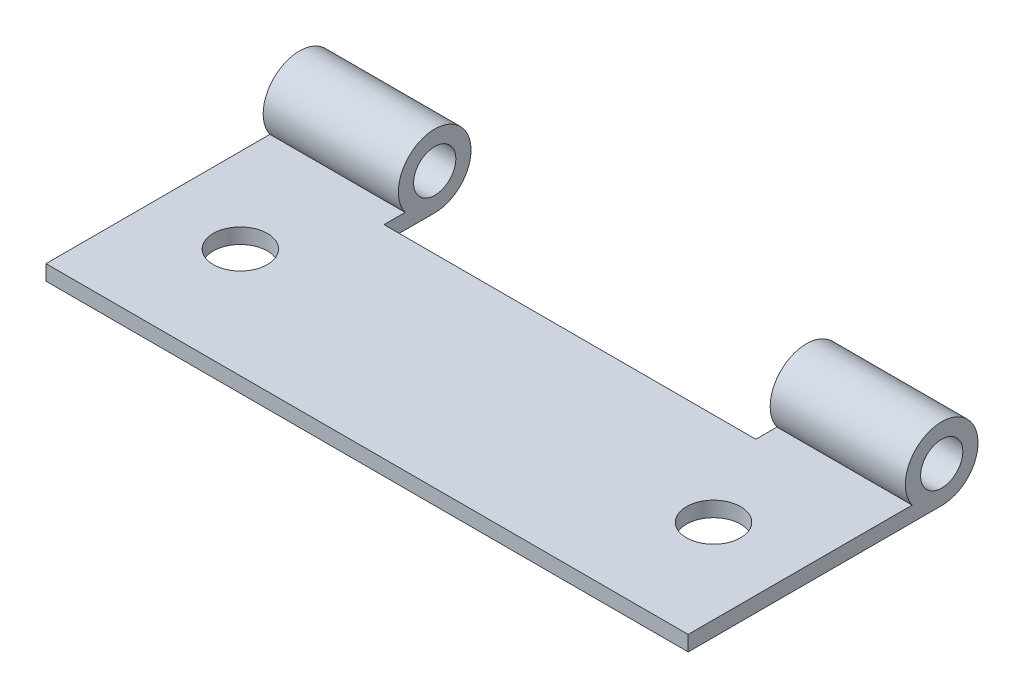
ISO-10303-21;
HEADER;
FILE_DESCRIPTION(('STEP AP214'),'2;1');
FILE_NAME('part.step','',(''),(''),'','','');
FILE_SCHEMA(('AUTOMOTIVE_DESIGN { 1 0 10303 214 1 1 1 1 }'));
ENDSEC;
DATA;
#1=APPLICATION_CONTEXT('core data for automotive mechanical design processes');
#2=APPLICATION_PROTOCOL_DEFINITION('international standard','automotive_design',2000,#1);
#3=PRODUCT_CONTEXT('',#1,'mechanical');
#4=PRODUCT('Part','Part','',(#3));
#5=PRODUCT_RELATED_PRODUCT_CATEGORY('part','',(#4));
#6=PRODUCT_DEFINITION_FORMATION('','',#4);
#7=PRODUCT_DEFINITION_CONTEXT('part definition',#1,'design');
#8=PRODUCT_DEFINITION('design','',#6,#7);
#9=PRODUCT_DEFINITION_SHAPE('','',#8);
#10=(LENGTH_UNIT() NAMED_UNIT(*) SI_UNIT(.MILLI.,.METRE.));
#11=(NAMED_UNIT(*) PLANE_ANGLE_UNIT() SI_UNIT($,.RADIAN.));
#12=(NAMED_UNIT(*) SI_UNIT($,.STERADIAN.) SOLID_ANGLE_UNIT());
#13=UNCERTAINTY_MEASURE_WITH_UNIT(LENGTH_MEASURE(1.E-05),#10,'distance_accuracy_value','');
#14=(GEOMETRIC_REPRESENTATION_CONTEXT(3) GLOBAL_UNCERTAINTY_ASSIGNED_CONTEXT((#13)) GLOBAL_UNIT_ASSIGNED_CONTEXT((#10,
#11,#12)) REPRESENTATION_CONTEXT('',''));
#15=CARTESIAN_POINT('',(0.,0.,0.));
#16=DIRECTION('',(0.,0.,1.));
#17=DIRECTION('',(1.,0.,0.));
#18=AXIS2_PLACEMENT_3D('',#15,#16,#17);
#19=CARTESIAN_POINT('',(38.,0.,0.));
#20=DIRECTION('',(-1.,0.,0.));
#21=DIRECTION('',(0.,0.,1.));
#22=AXIS2_PLACEMENT_3D('',#19,#20,#21);
#23=CYLINDRICAL_SURFACE('',#22,2.15);
#24=DIRECTION('',(-1.,0.,0.));
#25=VECTOR('',#24,1.);
#26=CARTESIAN_POINT('',(38.,-1.25,1.74928556845359));
#27=LINE('',#26,#25);
#28=CARTESIAN_POINT('',(8.,-1.25,1.74928556845359));
#29=VERTEX_POINT('',#28);
#30=CARTESIAN_POINT('',(0.,-1.25,1.74928556845359));
#31=VERTEX_POINT('',#30);
#32=EDGE_CURVE('E178',#29,#31,#27,.T.);
#33=ORIENTED_EDGE('',*,*,#32,.F.);
#34=CARTESIAN_POINT('',(8.,0.,0.));
#35=DIRECTION('',(-1.,0.,0.));
#36=DIRECTION('',(0.,0.,1.));
#37=AXIS2_PLACEMENT_3D('',#34,#35,#36);
#38=CIRCLE('',#37,2.15);
#39=CARTESIAN_POINT('',(8.,-2.15,0.));
#40=VERTEX_POINT('',#39);
#41=EDGE_CURVE('E139',#29,#40,#38,.T.);
#42=ORIENTED_EDGE('',*,*,#41,.T.);
#43=DIRECTION('',(-1.,0.,0.));
#44=VECTOR('',#43,1.);
#45=CARTESIAN_POINT('',(38.,-2.15,0.));
#46=LINE('',#45,#44);
#47=CARTESIAN_POINT('',(0.,-2.15,0.));
#48=VERTEX_POINT('',#47);
#49=EDGE_CURVE('E80',#40,#48,#46,.T.);
#50=ORIENTED_EDGE('',*,*,#49,.T.);
#51=CARTESIAN_POINT('',(0.,0.,0.));
#52=DIRECTION('',(1.,0.,0.));
#53=DIRECTION('',(0.,0.,-1.));
#54=AXIS2_PLACEMENT_3D('',#51,#52,#53);
#55=CIRCLE('',#54,2.15);
#56=EDGE_CURVE('E153',#48,#31,#55,.T.);
#57=ORIENTED_EDGE('',*,*,#56,.T.);
#58=EDGE_LOOP('',(#33,#42,#50,#57));
#59=FACE_BOUND('',#58,.T.);
#60=ADVANCED_FACE('F34',(#59),#23,.T.);
#61=CARTESIAN_POINT('',(38.,0.,0.));
#62=DIRECTION('',(-1.,0.,0.));
#63=DIRECTION('',(0.,0.,1.));
#64=AXIS2_PLACEMENT_3D('',#61,#62,#63);
#65=CYLINDRICAL_SURFACE('',#64,1.25);
#66=CARTESIAN_POINT('',(8.,0.,0.));
#67=DIRECTION('',(-1.,0.,0.));
#68=DIRECTION('',(0.,0.,1.));
#69=AXIS2_PLACEMENT_3D('',#66,#67,#68);
#70=CIRCLE('',#69,1.25);
#71=CARTESIAN_POINT('',(8.,0.,1.25));
#72=VERTEX_POINT('',#71);
#73=EDGE_CURVE('E128',#72,#72,#70,.T.);
#74=ORIENTED_EDGE('',*,*,#73,.F.);
#75=EDGE_LOOP('',(#74));
#76=FACE_BOUND('',#75,.T.);
#77=CARTESIAN_POINT('',(0.,0.,0.));
#78=DIRECTION('',(1.,0.,0.));
#79=DIRECTION('',(0.,0.,-1.));
#80=AXIS2_PLACEMENT_3D('',#77,#78,#79);
#81=CIRCLE('',#80,1.25);
#82=CARTESIAN_POINT('',(0.,0.,-1.25));
#83=VERTEX_POINT('',#82);
#84=EDGE_CURVE('E115',#83,#83,#81,.T.);
#85=ORIENTED_EDGE('',*,*,#84,.F.);
#86=EDGE_LOOP('',(#85));
#87=FACE_BOUND('',#86,.T.);
#88=ADVANCED_FACE('F213',(#76,#87),#65,.F.);
#89=CARTESIAN_POINT('',(38.,0.,0.));
#90=DIRECTION('',(1.,0.,0.));
#91=DIRECTION('',(0.,0.,-1.));
#92=AXIS2_PLACEMENT_3D('',#89,#90,#91);
#93=PLANE('',#92);
#94=CARTESIAN_POINT('',(38.,0.,0.));
#95=DIRECTION('',(1.,0.,0.));
#96=DIRECTION('',(0.,0.,-1.));
#97=AXIS2_PLACEMENT_3D('',#94,#95,#96);
#98=CIRCLE('',#97,2.15);
#99=CARTESIAN_POINT('',(38.,-2.15,0.));
#100=VERTEX_POINT('',#99);
#101=CARTESIAN_POINT('',(38.,-1.25,1.74928556845359));
#102=VERTEX_POINT('',#101);
#103=EDGE_CURVE('E156',#100,#102,#98,.T.);
#104=ORIENTED_EDGE('',*,*,#103,.T.);
#105=DIRECTION('',(0.,0.,1.));
#106=VECTOR('',#105,1.);
#107=CARTESIAN_POINT('',(38.,-1.25,1.74928556845359));
#108=LINE('',#107,#106);
#109=CARTESIAN_POINT('',(38.,-1.25,15.));
#110=VERTEX_POINT('',#109);
#111=EDGE_CURVE('E88',#102,#110,#108,.T.);
#112=ORIENTED_EDGE('',*,*,#111,.T.);
#113=DIRECTION('',(0.,-1.,0.));
#114=VECTOR('',#113,1.);
#115=CARTESIAN_POINT('',(38.,-2.15,15.));
#116=LINE('',#115,#114);
#117=CARTESIAN_POINT('',(38.,-2.15,15.));
#118=VERTEX_POINT('',#117);
#119=EDGE_CURVE('E160',#110,#118,#116,.T.);
#120=ORIENTED_EDGE('',*,*,#119,.T.);
#121=DIRECTION('',(0.,0.,-1.));
#122=VECTOR('',#121,1.);
#123=CARTESIAN_POINT('',(38.,-2.15,0.));
#124=LINE('',#123,#122);
#125=EDGE_CURVE('E58',#118,#100,#124,.T.);
#126=ORIENTED_EDGE('',*,*,#125,.T.);
#127=EDGE_LOOP('',(#104,#112,#120,#126));
#128=FACE_BOUND('',#127,.T.);
#129=CARTESIAN_POINT('',(38.,0.,0.));
#130=DIRECTION('',(1.,0.,0.));
#131=DIRECTION('',(0.,0.,-1.));
#132=AXIS2_PLACEMENT_3D('',#129,#130,#131);
#133=CIRCLE('',#132,1.25);
#134=CARTESIAN_POINT('',(38.,0.,-1.25));
#135=VERTEX_POINT('',#134);
#136=EDGE_CURVE('E150',#135,#135,#133,.T.);
#137=ORIENTED_EDGE('',*,*,#136,.F.);
#138=EDGE_LOOP('',(#137));
#139=FACE_BOUND('',#138,.T.);
#140=ADVANCED_FACE('F217',(#128,#139),#93,.T.);
#141=CARTESIAN_POINT('',(0.,0.,0.));
#142=DIRECTION('',(1.,0.,0.));
#143=DIRECTION('',(0.,0.,-1.));
#144=AXIS2_PLACEMENT_3D('',#141,#142,#143);
#145=PLANE('',#144);
#146=ORIENTED_EDGE('',*,*,#56,.F.);
#147=DIRECTION('',(0.,0.,-1.));
#148=VECTOR('',#147,1.);
#149=CARTESIAN_POINT('',(0.,-2.15,0.));
#150=LINE('',#149,#148);
#151=CARTESIAN_POINT('',(0.,-2.15,15.));
#152=VERTEX_POINT('',#151);
#153=EDGE_CURVE('E158',#152,#48,#150,.T.);
#154=ORIENTED_EDGE('',*,*,#153,.F.);
#155=DIRECTION('',(0.,-1.,0.));
#156=VECTOR('',#155,1.);
#157=CARTESIAN_POINT('',(0.,-2.15,15.));
#158=LINE('',#157,#156);
#159=CARTESIAN_POINT('',(0.,-1.25,15.));
#160=VERTEX_POINT('',#159);
#161=EDGE_CURVE('E166',#160,#152,#158,.T.);
#162=ORIENTED_EDGE('',*,*,#161,.F.);
#163=DIRECTION('',(0.,0.,1.));
#164=VECTOR('',#163,1.);
#165=CARTESIAN_POINT('',(0.,-1.25,1.74928556845359));
#166=LINE('',#165,#164);
#167=EDGE_CURVE('E164',#31,#160,#166,.T.);
#168=ORIENTED_EDGE('',*,*,#167,.F.);
#169=EDGE_LOOP('',(#146,#154,#162,#168));
#170=FACE_BOUND('',#169,.T.);
#171=ORIENTED_EDGE('',*,*,#84,.T.);
#172=EDGE_LOOP('',(#171));
#173=FACE_BOUND('',#172,.T.);
#174=ADVANCED_FACE('F222',(#170,#173),#145,.F.);
#175=CARTESIAN_POINT('',(30.,-2.15,0.));
#176=VERTEX_POINT('',#175);
#177=EDGE_CURVE('E169',#100,#176,#46,.T.);
#178=ORIENTED_EDGE('',*,*,#177,.T.);
#179=CARTESIAN_POINT('',(30.,0.,0.));
#180=DIRECTION('',(1.,0.,0.));
#181=DIRECTION('',(0.,0.,-1.));
#182=AXIS2_PLACEMENT_3D('',#179,#180,#181);
#183=CIRCLE('',#182,2.15);
#184=CARTESIAN_POINT('',(30.,-1.25,1.74928556845359));
#185=VERTEX_POINT('',#184);
#186=EDGE_CURVE('E129',#176,#185,#183,.T.);
#187=ORIENTED_EDGE('',*,*,#186,.T.);
#188=EDGE_CURVE('E42',#102,#185,#27,.T.);
#189=ORIENTED_EDGE('',*,*,#188,.F.);
#190=ORIENTED_EDGE('',*,*,#103,.F.);
#191=EDGE_LOOP('',(#178,#187,#189,#190));
#192=FACE_BOUND('',#191,.T.);
#193=ADVANCED_FACE('F36',(#192),#23,.T.);
#194=CARTESIAN_POINT('',(38.,-1.25,1.74928556845359));
#195=DIRECTION('',(0.,-1.,0.));
#196=DIRECTION('',(0.,0.,-1.));
#197=AXIS2_PLACEMENT_3D('',#194,#195,#196);
#198=PLANE('',#197);
#199=CARTESIAN_POINT('',(33.,-1.25,8.5));
#200=DIRECTION('',(0.,-1.,0.));
#201=DIRECTION('',(0.,0.,-1.));
#202=AXIS2_PLACEMENT_3D('',#199,#200,#201);
#203=CIRCLE('',#202,1.6);
#204=CARTESIAN_POINT('',(33.,-1.25,6.9));
#205=VERTEX_POINT('',#204);
#206=EDGE_CURVE('E116',#205,#205,#203,.T.);
#207=ORIENTED_EDGE('',*,*,#206,.T.);
#208=EDGE_LOOP('',(#207));
#209=FACE_BOUND('',#208,.T.);
#210=CARTESIAN_POINT('',(5.,-1.25,8.5));
#211=DIRECTION('',(0.,-1.,0.));
#212=DIRECTION('',(0.,0.,-1.));
#213=AXIS2_PLACEMENT_3D('',#210,#211,#212);
#214=CIRCLE('',#213,1.59999999999999);
#215=CARTESIAN_POINT('',(5.,-1.25,6.90000000000001));
#216=VERTEX_POINT('',#215);
#217=EDGE_CURVE('E144',#216,#216,#214,.T.);
#218=ORIENTED_EDGE('',*,*,#217,.T.);
#219=EDGE_LOOP('',(#218));
#220=FACE_BOUND('',#219,.T.);
#221=DIRECTION('',(-1.,0.,0.));
#222=VECTOR('',#221,1.);
#223=CARTESIAN_POINT('',(38.,-1.25,3.));
#224=LINE('',#223,#222);
#225=CARTESIAN_POINT('',(30.,-1.25,3.));
#226=VERTEX_POINT('',#225);
#227=CARTESIAN_POINT('',(8.,-1.25,3.));
#228=VERTEX_POINT('',#227);
#229=EDGE_CURVE('E109',#226,#228,#224,.T.);
#230=ORIENTED_EDGE('',*,*,#229,.T.);
#231=DIRECTION('',(0.,0.,-1.));
#232=VECTOR('',#231,1.);
#233=CARTESIAN_POINT('',(8.,-1.25,1.7492855684536));
#234=LINE('',#233,#232);
#235=EDGE_CURVE('E141',#228,#29,#234,.T.);
#236=ORIENTED_EDGE('',*,*,#235,.T.);
#237=ORIENTED_EDGE('',*,*,#32,.T.);
#238=ORIENTED_EDGE('',*,*,#167,.T.);
#239=DIRECTION('',(-1.,0.,0.));
#240=VECTOR('',#239,1.);
#241=CARTESIAN_POINT('',(38.,-1.25,15.));
#242=LINE('',#241,#240);
#243=EDGE_CURVE('E175',#110,#160,#242,.T.);
#244=ORIENTED_EDGE('',*,*,#243,.F.);
#245=ORIENTED_EDGE('',*,*,#111,.F.);
#246=ORIENTED_EDGE('',*,*,#188,.T.);
#247=DIRECTION('',(0.,0.,1.));
#248=VECTOR('',#247,1.);
#249=CARTESIAN_POINT('',(30.,-1.25,1.74928556845359));
#250=LINE('',#249,#248);
#251=EDGE_CURVE('E120',#185,#226,#250,.T.);
#252=ORIENTED_EDGE('',*,*,#251,.T.);
#253=EDGE_LOOP('',(#230,#236,#237,#238,#244,#245,#246,#252));
#254=FACE_BOUND('',#253,.T.);
#255=ADVANCED_FACE('F126',(#209,#220,#254),#198,.F.);
#256=CARTESIAN_POINT('',(38.,-2.15,15.));
#257=DIRECTION('',(0.,0.,-1.));
#258=DIRECTION('',(-1.,0.,0.));
#259=AXIS2_PLACEMENT_3D('',#256,#257,#258);
#260=PLANE('',#259);
#261=ORIENTED_EDGE('',*,*,#161,.T.);
#262=DIRECTION('',(-1.,0.,0.));
#263=VECTOR('',#262,1.);
#264=CARTESIAN_POINT('',(38.,-2.15,15.));
#265=LINE('',#264,#263);
#266=EDGE_CURVE('E172',#118,#152,#265,.T.);
#267=ORIENTED_EDGE('',*,*,#266,.F.);
#268=ORIENTED_EDGE('',*,*,#119,.F.);
#269=ORIENTED_EDGE('',*,*,#243,.T.);
#270=EDGE_LOOP('',(#261,#267,#268,#269));
#271=FACE_BOUND('',#270,.T.);
#272=ADVANCED_FACE('F198',(#271),#260,.F.);
#273=CARTESIAN_POINT('',(38.,-2.15,0.));
#274=DIRECTION('',(0.,1.,0.));
#275=DIRECTION('',(0.,0.,1.));
#276=AXIS2_PLACEMENT_3D('',#273,#274,#275);
#277=PLANE('',#276);
#278=ORIENTED_EDGE('',*,*,#49,.F.);
#279=DIRECTION('',(0.,0.,1.));
#280=VECTOR('',#279,1.);
#281=CARTESIAN_POINT('',(8.,-2.15,0.));
#282=LINE('',#281,#280);
#283=CARTESIAN_POINT('',(8.,-2.15,3.));
#284=VERTEX_POINT('',#283);
#285=EDGE_CURVE('E132',#40,#284,#282,.T.);
#286=ORIENTED_EDGE('',*,*,#285,.T.);
#287=DIRECTION('',(1.,0.,0.));
#288=VECTOR('',#287,1.);
#289=CARTESIAN_POINT('',(38.,-2.15,3.));
#290=LINE('',#289,#288);
#291=CARTESIAN_POINT('',(30.,-2.15,3.));
#292=VERTEX_POINT('',#291);
#293=EDGE_CURVE('E11',#284,#292,#290,.T.);
#294=ORIENTED_EDGE('',*,*,#293,.T.);
#295=DIRECTION('',(0.,0.,-1.));
#296=VECTOR('',#295,1.);
#297=CARTESIAN_POINT('',(30.,-2.15,0.));
#298=LINE('',#297,#296);
#299=EDGE_CURVE('E123',#292,#176,#298,.T.);
#300=ORIENTED_EDGE('',*,*,#299,.T.);
#301=ORIENTED_EDGE('',*,*,#177,.F.);
#302=ORIENTED_EDGE('',*,*,#125,.F.);
#303=ORIENTED_EDGE('',*,*,#266,.T.);
#304=ORIENTED_EDGE('',*,*,#153,.T.);
#305=EDGE_LOOP('',(#278,#286,#294,#300,#301,#302,#303,#304));
#306=FACE_BOUND('',#305,.T.);
#307=CARTESIAN_POINT('',(33.,-2.15,8.5));
#308=DIRECTION('',(0.,1.,0.));
#309=DIRECTION('',(0.,0.,1.));
#310=AXIS2_PLACEMENT_3D('',#307,#308,#309);
#311=CIRCLE('',#310,1.6);
#312=CARTESIAN_POINT('',(33.,-2.15,10.1));
#313=VERTEX_POINT('',#312);
#314=EDGE_CURVE('E147',#313,#313,#311,.T.);
#315=ORIENTED_EDGE('',*,*,#314,.T.);
#316=EDGE_LOOP('',(#315));
#317=FACE_BOUND('',#316,.T.);
#318=CARTESIAN_POINT('',(5.,-2.15,8.5));
#319=DIRECTION('',(0.,1.,0.));
#320=DIRECTION('',(0.,0.,1.));
#321=AXIS2_PLACEMENT_3D('',#318,#319,#320);
#322=CIRCLE('',#321,1.59999999999999);
#323=CARTESIAN_POINT('',(5.,-2.15,10.1));
#324=VERTEX_POINT('',#323);
#325=EDGE_CURVE('E143',#324,#324,#322,.T.);
#326=ORIENTED_EDGE('',*,*,#325,.T.);
#327=EDGE_LOOP('',(#326));
#328=FACE_BOUND('',#327,.T.);
#329=ADVANCED_FACE('F186',(#306,#317,#328),#277,.F.);
#330=CARTESIAN_POINT('',(30.,0.,0.));
#331=DIRECTION('',(1.,0.,0.));
#332=DIRECTION('',(0.,0.,-1.));
#333=AXIS2_PLACEMENT_3D('',#330,#331,#332);
#334=CIRCLE('',#333,1.25);
#335=CARTESIAN_POINT('',(30.,0.,-1.25));
#336=VERTEX_POINT('',#335);
#337=EDGE_CURVE('E124',#336,#336,#334,.T.);
#338=ORIENTED_EDGE('',*,*,#337,.F.);
#339=EDGE_LOOP('',(#338));
#340=FACE_BOUND('',#339,.T.);
#341=ORIENTED_EDGE('',*,*,#136,.T.);
#342=EDGE_LOOP('',(#341));
#343=FACE_BOUND('',#342,.T.);
#344=ADVANCED_FACE('F219',(#340,#343),#65,.F.);
#345=CARTESIAN_POINT('',(8.,-19.,3.));
#346=DIRECTION('',(0.,0.,1.));
#347=DIRECTION('',(1.,0.,0.));
#348=AXIS2_PLACEMENT_3D('',#345,#346,#347);
#349=PLANE('',#348);
#350=DIRECTION('',(0.,1.,0.));
#351=VECTOR('',#350,1.);
#352=CARTESIAN_POINT('',(30.,-19.,3.));
#353=LINE('',#352,#351);
#354=EDGE_CURVE('E49',#292,#226,#353,.T.);
#355=ORIENTED_EDGE('',*,*,#354,.F.);
#356=ORIENTED_EDGE('',*,*,#293,.F.);
#357=DIRECTION('',(0.,1.,0.));
#358=VECTOR('',#357,1.);
#359=CARTESIAN_POINT('',(8.,-19.,3.));
#360=LINE('',#359,#358);
#361=EDGE_CURVE('E112',#284,#228,#360,.T.);
#362=ORIENTED_EDGE('',*,*,#361,.T.);
#363=ORIENTED_EDGE('',*,*,#229,.F.);
#364=EDGE_LOOP('',(#355,#356,#362,#363));
#365=FACE_BOUND('',#364,.T.);
#366=ADVANCED_FACE('F110',(#365),#349,.F.);
#367=CARTESIAN_POINT('',(8.,-19.,-4.89013019203827));
#368=DIRECTION('',(-1.,0.,0.));
#369=DIRECTION('',(0.,0.,1.));
#370=AXIS2_PLACEMENT_3D('',#367,#368,#369);
#371=PLANE('',#370);
#372=ORIENTED_EDGE('',*,*,#73,.T.);
#373=EDGE_LOOP('',(#372));
#374=FACE_BOUND('',#373,.T.);
#375=ORIENTED_EDGE('',*,*,#361,.F.);
#376=ORIENTED_EDGE('',*,*,#285,.F.);
#377=ORIENTED_EDGE('',*,*,#41,.F.);
#378=ORIENTED_EDGE('',*,*,#235,.F.);
#379=EDGE_LOOP('',(#375,#376,#377,#378));
#380=FACE_BOUND('',#379,.T.);
#381=ADVANCED_FACE('F207',(#374,#380),#371,.F.);
#382=CARTESIAN_POINT('',(30.,-19.,-4.89013019203827));
#383=DIRECTION('',(1.,0.,0.));
#384=DIRECTION('',(0.,0.,-1.));
#385=AXIS2_PLACEMENT_3D('',#382,#383,#384);
#386=PLANE('',#385);
#387=ORIENTED_EDGE('',*,*,#337,.T.);
#388=EDGE_LOOP('',(#387));
#389=FACE_BOUND('',#388,.T.);
#390=ORIENTED_EDGE('',*,*,#186,.F.);
#391=ORIENTED_EDGE('',*,*,#299,.F.);
#392=ORIENTED_EDGE('',*,*,#354,.T.);
#393=ORIENTED_EDGE('',*,*,#251,.F.);
#394=EDGE_LOOP('',(#390,#391,#392,#393));
#395=FACE_BOUND('',#394,.T.);
#396=ADVANCED_FACE('F119',(#389,#395),#386,.F.);
#397=CARTESIAN_POINT('',(5.,-19.,8.5));
#398=DIRECTION('',(0.,1.,0.));
#399=DIRECTION('',(0.,0.,1.));
#400=AXIS2_PLACEMENT_3D('',#397,#398,#399);
#401=CYLINDRICAL_SURFACE('',#400,1.59999999999999);
#402=ORIENTED_EDGE('',*,*,#325,.F.);
#403=EDGE_LOOP('',(#402));
#404=FACE_BOUND('',#403,.T.);
#405=ORIENTED_EDGE('',*,*,#217,.F.);
#406=EDGE_LOOP('',(#405));
#407=FACE_BOUND('',#406,.T.);
#408=ADVANCED_FACE('F192',(#404,#407),#401,.F.);
#409=CARTESIAN_POINT('',(33.,-19.,8.5));
#410=DIRECTION('',(0.,1.,0.));
#411=DIRECTION('',(0.,0.,1.));
#412=AXIS2_PLACEMENT_3D('',#409,#410,#411);
#413=CYLINDRICAL_SURFACE('',#412,1.6);
#414=ORIENTED_EDGE('',*,*,#314,.F.);
#415=EDGE_LOOP('',(#414));
#416=FACE_BOUND('',#415,.T.);
#417=ORIENTED_EDGE('',*,*,#206,.F.);
#418=EDGE_LOOP('',(#417));
#419=FACE_BOUND('',#418,.T.);
#420=ADVANCED_FACE('F189',(#416,#419),#413,.F.);
#421=CLOSED_SHELL('',(#60,#88,#140,#174,#193,#255,#272,#329,#344,#366,#381,#396,#408,#420));
#422=MANIFOLD_SOLID_BREP('B2',#421);
#423=ADVANCED_BREP_SHAPE_REPRESENTATION('',(#18,#422),#14);
#424=SHAPE_DEFINITION_REPRESENTATION(#9,#423);
ENDSEC;
END-ISO-10303-21;
